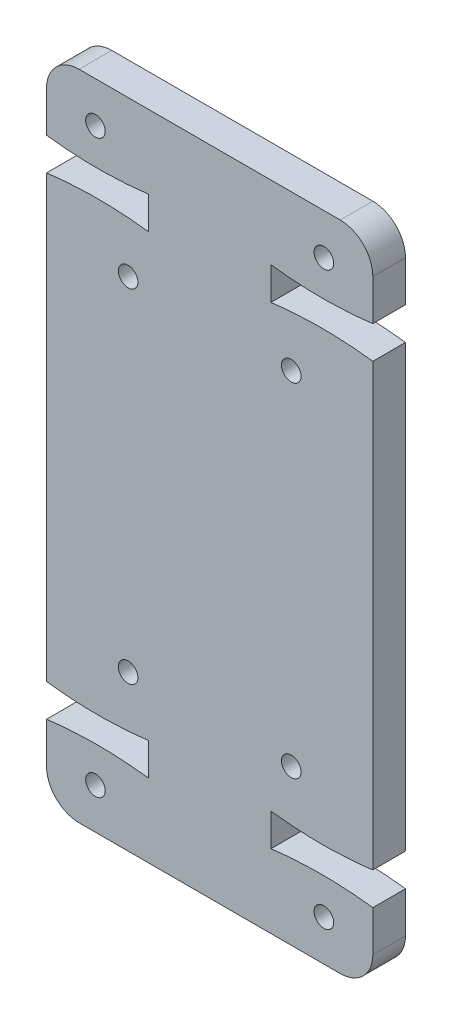
ISO-10303-21;
HEADER;
FILE_DESCRIPTION(('STEP AP214'),'2;1');
FILE_NAME('part.step','',(''),(''),'','','');
FILE_SCHEMA(('AUTOMOTIVE_DESIGN { 1 0 10303 214 1 1 1 1 }'));
ENDSEC;
DATA;
#1=APPLICATION_CONTEXT('core data for automotive mechanical design processes');
#2=APPLICATION_PROTOCOL_DEFINITION('international standard','automotive_design',2000,#1);
#3=PRODUCT_CONTEXT('',#1,'mechanical');
#4=PRODUCT('Part','Part','',(#3));
#5=PRODUCT_RELATED_PRODUCT_CATEGORY('part','',(#4));
#6=PRODUCT_DEFINITION_FORMATION('','',#4);
#7=PRODUCT_DEFINITION_CONTEXT('part definition',#1,'design');
#8=PRODUCT_DEFINITION('design','',#6,#7);
#9=PRODUCT_DEFINITION_SHAPE('','',#8);
#10=(LENGTH_UNIT() NAMED_UNIT(*) SI_UNIT(.MILLI.,.METRE.));
#11=(NAMED_UNIT(*) PLANE_ANGLE_UNIT() SI_UNIT($,.RADIAN.));
#12=(NAMED_UNIT(*) SI_UNIT($,.STERADIAN.) SOLID_ANGLE_UNIT());
#13=UNCERTAINTY_MEASURE_WITH_UNIT(LENGTH_MEASURE(1.E-05),#10,'distance_accuracy_value','');
#14=(GEOMETRIC_REPRESENTATION_CONTEXT(3) GLOBAL_UNCERTAINTY_ASSIGNED_CONTEXT((#13)) GLOBAL_UNIT_ASSIGNED_CONTEXT((#10,
#11,#12)) REPRESENTATION_CONTEXT('',''));
#15=CARTESIAN_POINT('',(0.,0.,0.));
#16=DIRECTION('',(0.,0.,1.));
#17=DIRECTION('',(1.,0.,0.));
#18=AXIS2_PLACEMENT_3D('',#15,#16,#17);
#19=CARTESIAN_POINT('',(16.875,4.7,2.));
#20=DIRECTION('',(0.,0.,-1.));
#21=DIRECTION('',(-1.,0.,0.));
#22=AXIS2_PLACEMENT_3D('',#19,#20,#21);
#23=PLANE('',#22);
#24=CARTESIAN_POINT('',(15.,9.5,2.));
#25=DIRECTION('',(0.,0.,1.));
#26=DIRECTION('',(-1.,0.,0.));
#27=AXIS2_PLACEMENT_3D('',#24,#25,#26);
#28=CIRCLE('',#27,0.6);
#29=CARTESIAN_POINT('',(14.4,9.5,2.));
#30=VERTEX_POINT('',#29);
#31=EDGE_CURVE('E877',#30,#30,#28,.T.);
#32=ORIENTED_EDGE('',*,*,#31,.F.);
#33=EDGE_LOOP('',(#32));
#34=FACE_BOUND('',#33,.T.);
#35=CARTESIAN_POINT('',(17.,37.5,2.));
#36=DIRECTION('',(0.,0.,1.));
#37=DIRECTION('',(1.,0.,0.));
#38=AXIS2_PLACEMENT_3D('',#35,#36,#37);
#39=CIRCLE('',#38,0.600000000000001);
#40=CARTESIAN_POINT('',(17.6,37.5,2.));
#41=VERTEX_POINT('',#40);
#42=EDGE_CURVE('E865',#41,#41,#39,.T.);
#43=ORIENTED_EDGE('',*,*,#42,.F.);
#44=EDGE_LOOP('',(#43));
#45=FACE_BOUND('',#44,.T.);
#46=CARTESIAN_POINT('',(5.,30.5,2.));
#47=DIRECTION('',(0.,0.,1.));
#48=DIRECTION('',(-1.,0.,0.));
#49=AXIS2_PLACEMENT_3D('',#46,#47,#48);
#50=CIRCLE('',#49,0.6);
#51=CARTESIAN_POINT('',(4.4,30.5,2.));
#52=VERTEX_POINT('',#51);
#53=EDGE_CURVE('E853',#52,#52,#50,.T.);
#54=ORIENTED_EDGE('',*,*,#53,.F.);
#55=EDGE_LOOP('',(#54));
#56=FACE_BOUND('',#55,.T.);
#57=CARTESIAN_POINT('',(3.,2.5,2.));
#58=DIRECTION('',(0.,0.,1.));
#59=DIRECTION('',(1.,0.,0.));
#60=AXIS2_PLACEMENT_3D('',#57,#58,#59);
#61=CIRCLE('',#60,0.6);
#62=CARTESIAN_POINT('',(3.6,2.5,2.));
#63=VERTEX_POINT('',#62);
#64=EDGE_CURVE('E299',#63,#63,#61,.T.);
#65=ORIENTED_EDGE('',*,*,#64,.F.);
#66=EDGE_LOOP('',(#65));
#67=FACE_BOUND('',#66,.T.);
#68=DIRECTION('',(-1.,0.,0.));
#69=VECTOR('',#68,1.);
#70=CARTESIAN_POINT('',(0.,40.,2.));
#71=LINE('',#70,#69);
#72=CARTESIAN_POINT('',(18.,40.,2.));
#73=VERTEX_POINT('',#72);
#74=CARTESIAN_POINT('',(2.,40.,2.));
#75=VERTEX_POINT('',#74);
#76=EDGE_CURVE('E734',#73,#75,#71,.T.);
#77=ORIENTED_EDGE('',*,*,#76,.T.);
#78=CARTESIAN_POINT('',(2.,38.,2.));
#79=DIRECTION('',(0.,0.,-1.));
#80=DIRECTION('',(-1.,0.,0.));
#81=AXIS2_PLACEMENT_3D('',#78,#79,#80);
#82=CIRCLE('',#81,2.);
#83=CARTESIAN_POINT('',(0.,38.,2.));
#84=VERTEX_POINT('',#83);
#85=EDGE_CURVE('E441',#75,#84,#82,.F.);
#86=ORIENTED_EDGE('',*,*,#85,.T.);
#87=DIRECTION('',(0.,-1.,0.));
#88=VECTOR('',#87,1.);
#89=CARTESIAN_POINT('',(0.,35.5,2.));
#90=LINE('',#89,#88);
#91=CARTESIAN_POINT('',(0.,35.5,2.));
#92=VERTEX_POINT('',#91);
#93=EDGE_CURVE('E740',#84,#92,#90,.T.);
#94=ORIENTED_EDGE('',*,*,#93,.T.);
#95=CARTESIAN_POINT('',(0.,35.5,2.));
#96=CARTESIAN_POINT('',(3.125,35.1,2.));
#97=CARTESIAN_POINT('',(6.25,35.5,2.));
#98=B_SPLINE_CURVE_WITH_KNOTS('',2,(#95,#96,#97),.UNSPECIFIED.,.F.,.F.,(3,3),(0.,1.),.UNSPECIFIED.);
#99=CARTESIAN_POINT('',(6.25,35.5,2.));
#100=VERTEX_POINT('',#99);
#101=EDGE_CURVE('E742',#92,#100,#98,.T.);
#102=ORIENTED_EDGE('',*,*,#101,.T.);
#103=DIRECTION('',(0.,-1.,0.));
#104=VECTOR('',#103,1.);
#105=CARTESIAN_POINT('',(6.25,35.5,2.));
#106=LINE('',#105,#104);
#107=CARTESIAN_POINT('',(6.25,33.5,2.));
#108=VERTEX_POINT('',#107);
#109=EDGE_CURVE('E750',#100,#108,#106,.T.);
#110=ORIENTED_EDGE('',*,*,#109,.T.);
#111=CARTESIAN_POINT('',(6.25,33.5,2.));
#112=CARTESIAN_POINT('',(3.125,33.9,2.));
#113=CARTESIAN_POINT('',(0.,33.5,2.));
#114=B_SPLINE_CURVE_WITH_KNOTS('',2,(#111,#112,#113),.UNSPECIFIED.,.F.,.F.,(3,3),(0.,1.),.UNSPECIFIED.);
#115=CARTESIAN_POINT('',(0.,33.5,2.));
#116=VERTEX_POINT('',#115);
#117=EDGE_CURVE('E812',#108,#116,#114,.T.);
#118=ORIENTED_EDGE('',*,*,#117,.T.);
#119=DIRECTION('',(0.,-1.,0.));
#120=VECTOR('',#119,1.);
#121=CARTESIAN_POINT('',(0.,6.49999999999997,2.));
#122=LINE('',#121,#120);
#123=CARTESIAN_POINT('',(0.,6.49999999999997,2.));
#124=VERTEX_POINT('',#123);
#125=EDGE_CURVE('E816',#116,#124,#122,.T.);
#126=ORIENTED_EDGE('',*,*,#125,.T.);
#127=CARTESIAN_POINT('',(0.,6.49999999999997,2.));
#128=CARTESIAN_POINT('',(3.125,6.09999999999998,2.));
#129=CARTESIAN_POINT('',(6.25,6.49999999999997,2.));
#130=B_SPLINE_CURVE_WITH_KNOTS('',2,(#127,#128,#129),.UNSPECIFIED.,.F.,.F.,(3,3),(0.,1.),.UNSPECIFIED.);
#131=CARTESIAN_POINT('',(6.25,6.49999999999997,2.));
#132=VERTEX_POINT('',#131);
#133=EDGE_CURVE('E817',#124,#132,#130,.T.);
#134=ORIENTED_EDGE('',*,*,#133,.T.);
#135=DIRECTION('',(0.,-1.,0.));
#136=VECTOR('',#135,1.);
#137=CARTESIAN_POINT('',(6.25,4.5,2.));
#138=LINE('',#137,#136);
#139=CARTESIAN_POINT('',(6.25,4.5,2.));
#140=VERTEX_POINT('',#139);
#141=EDGE_CURVE('E290',#132,#140,#138,.T.);
#142=ORIENTED_EDGE('',*,*,#141,.T.);
#143=CARTESIAN_POINT('',(6.25,4.5,2.));
#144=CARTESIAN_POINT('',(3.125,4.9,2.));
#145=CARTESIAN_POINT('',(0.,4.5,2.));
#146=B_SPLINE_CURVE_WITH_KNOTS('',2,(#143,#144,#145),.UNSPECIFIED.,.F.,.F.,(3,3),(0.,1.),.UNSPECIFIED.);
#147=CARTESIAN_POINT('',(0.,4.5,2.));
#148=VERTEX_POINT('',#147);
#149=EDGE_CURVE('E283',#140,#148,#146,.T.);
#150=ORIENTED_EDGE('',*,*,#149,.T.);
#151=DIRECTION('',(0.,-1.,0.));
#152=VECTOR('',#151,1.);
#153=CARTESIAN_POINT('',(0.,4.5,2.));
#154=LINE('',#153,#152);
#155=CARTESIAN_POINT('',(0.,2.,2.));
#156=VERTEX_POINT('',#155);
#157=EDGE_CURVE('E375',#148,#156,#154,.T.);
#158=ORIENTED_EDGE('',*,*,#157,.T.);
#159=CARTESIAN_POINT('',(2.,2.,2.));
#160=DIRECTION('',(0.,0.,-1.));
#161=DIRECTION('',(-1.,0.,0.));
#162=AXIS2_PLACEMENT_3D('',#159,#160,#161);
#163=CIRCLE('',#162,2.);
#164=CARTESIAN_POINT('',(2.,0.,2.));
#165=VERTEX_POINT('',#164);
#166=EDGE_CURVE('E436',#156,#165,#163,.F.);
#167=ORIENTED_EDGE('',*,*,#166,.T.);
#168=DIRECTION('',(1.,0.,0.));
#169=VECTOR('',#168,1.);
#170=CARTESIAN_POINT('',(0.,0.,2.));
#171=LINE('',#170,#169);
#172=CARTESIAN_POINT('',(18.,0.,2.));
#173=VERTEX_POINT('',#172);
#174=EDGE_CURVE('E203',#165,#173,#171,.T.);
#175=ORIENTED_EDGE('',*,*,#174,.T.);
#176=CARTESIAN_POINT('',(18.,2.,2.));
#177=DIRECTION('',(0.,0.,-1.));
#178=DIRECTION('',(-1.,0.,0.));
#179=AXIS2_PLACEMENT_3D('',#176,#177,#178);
#180=CIRCLE('',#179,2.);
#181=CARTESIAN_POINT('',(20.,2.,2.));
#182=VERTEX_POINT('',#181);
#183=EDGE_CURVE('E56',#173,#182,#180,.F.);
#184=ORIENTED_EDGE('',*,*,#183,.T.);
#185=DIRECTION('',(0.,1.,0.));
#186=VECTOR('',#185,1.);
#187=CARTESIAN_POINT('',(20.,4.5,2.));
#188=LINE('',#187,#186);
#189=CARTESIAN_POINT('',(20.,4.5,2.));
#190=VERTEX_POINT('',#189);
#191=EDGE_CURVE('E193',#182,#190,#188,.T.);
#192=ORIENTED_EDGE('',*,*,#191,.T.);
#193=CARTESIAN_POINT('',(20.,4.5,2.));
#194=CARTESIAN_POINT('',(16.875,4.9,2.));
#195=CARTESIAN_POINT('',(13.75,4.5,2.));
#196=B_SPLINE_CURVE_WITH_KNOTS('',2,(#193,#194,#195),.UNSPECIFIED.,.F.,.F.,(3,3),(0.,1.),.UNSPECIFIED.);
#197=CARTESIAN_POINT('',(13.75,4.5,2.));
#198=VERTEX_POINT('',#197);
#199=EDGE_CURVE('E198',#190,#198,#196,.T.);
#200=ORIENTED_EDGE('',*,*,#199,.T.);
#201=DIRECTION('',(0.,1.,0.));
#202=VECTOR('',#201,1.);
#203=CARTESIAN_POINT('',(13.75,4.5,2.));
#204=LINE('',#203,#202);
#205=CARTESIAN_POINT('',(13.75,6.49999999999997,2.));
#206=VERTEX_POINT('',#205);
#207=EDGE_CURVE('E218',#198,#206,#204,.T.);
#208=ORIENTED_EDGE('',*,*,#207,.T.);
#209=CARTESIAN_POINT('',(13.75,6.49999999999997,2.));
#210=CARTESIAN_POINT('',(16.875,6.09999999999997,2.));
#211=CARTESIAN_POINT('',(20.,6.49999999999997,2.));
#212=B_SPLINE_CURVE_WITH_KNOTS('',2,(#209,#210,#211),.UNSPECIFIED.,.F.,.F.,(3,3),(0.,1.),.UNSPECIFIED.);
#213=CARTESIAN_POINT('',(20.,6.49999999999997,2.));
#214=VERTEX_POINT('',#213);
#215=EDGE_CURVE('E220',#206,#214,#212,.T.);
#216=ORIENTED_EDGE('',*,*,#215,.T.);
#217=DIRECTION('',(0.,1.,0.));
#218=VECTOR('',#217,1.);
#219=CARTESIAN_POINT('',(20.,6.49999999999997,2.));
#220=LINE('',#219,#218);
#221=CARTESIAN_POINT('',(20.,33.5,2.));
#222=VERTEX_POINT('',#221);
#223=EDGE_CURVE('E464',#214,#222,#220,.T.);
#224=ORIENTED_EDGE('',*,*,#223,.T.);
#225=CARTESIAN_POINT('',(20.,33.5,2.));
#226=CARTESIAN_POINT('',(16.875,33.9,2.));
#227=CARTESIAN_POINT('',(13.75,33.5,2.));
#228=B_SPLINE_CURVE_WITH_KNOTS('',2,(#225,#226,#227),.UNSPECIFIED.,.F.,.F.,(3,3),(0.,1.),.UNSPECIFIED.);
#229=CARTESIAN_POINT('',(13.75,33.5,2.));
#230=VERTEX_POINT('',#229);
#231=EDGE_CURVE('E472',#222,#230,#228,.T.);
#232=ORIENTED_EDGE('',*,*,#231,.T.);
#233=DIRECTION('',(0.,1.,0.));
#234=VECTOR('',#233,1.);
#235=CARTESIAN_POINT('',(13.75,35.5,2.));
#236=LINE('',#235,#234);
#237=CARTESIAN_POINT('',(13.75,35.5,2.));
#238=VERTEX_POINT('',#237);
#239=EDGE_CURVE('E474',#230,#238,#236,.T.);
#240=ORIENTED_EDGE('',*,*,#239,.T.);
#241=CARTESIAN_POINT('',(13.75,35.5,2.));
#242=CARTESIAN_POINT('',(16.875,35.1,2.));
#243=CARTESIAN_POINT('',(20.,35.5,2.));
#244=B_SPLINE_CURVE_WITH_KNOTS('',2,(#241,#242,#243),.UNSPECIFIED.,.F.,.F.,(3,3),(0.,1.),.UNSPECIFIED.);
#245=CARTESIAN_POINT('',(20.,35.5,2.));
#246=VERTEX_POINT('',#245);
#247=EDGE_CURVE('E728',#238,#246,#244,.T.);
#248=ORIENTED_EDGE('',*,*,#247,.T.);
#249=DIRECTION('',(0.,1.,0.));
#250=VECTOR('',#249,1.);
#251=CARTESIAN_POINT('',(20.,35.5,2.));
#252=LINE('',#251,#250);
#253=CARTESIAN_POINT('',(20.,38.,2.));
#254=VERTEX_POINT('',#253);
#255=EDGE_CURVE('E736',#246,#254,#252,.T.);
#256=ORIENTED_EDGE('',*,*,#255,.T.);
#257=CARTESIAN_POINT('',(18.,38.,2.));
#258=DIRECTION('',(0.,0.,-1.));
#259=DIRECTION('',(-1.,0.,0.));
#260=AXIS2_PLACEMENT_3D('',#257,#258,#259);
#261=CIRCLE('',#260,2.);
#262=EDGE_CURVE('E439',#254,#73,#261,.F.);
#263=ORIENTED_EDGE('',*,*,#262,.T.);
#264=EDGE_LOOP('',(#77,#86,#94,#102,#110,#118,#126,#134,#142,#150,#158,#167,#175,#184,#192,#200,
#208,#216,#224,#232,#240,#248,#256,#263));
#265=FACE_BOUND('',#264,.T.);
#266=CARTESIAN_POINT('',(5.,9.5,2.));
#267=DIRECTION('',(0.,0.,1.));
#268=DIRECTION('',(1.,0.,0.));
#269=AXIS2_PLACEMENT_3D('',#266,#267,#268);
#270=CIRCLE('',#269,0.6);
#271=CARTESIAN_POINT('',(5.6,9.5,2.));
#272=VERTEX_POINT('',#271);
#273=EDGE_CURVE('E847',#272,#272,#270,.T.);
#274=ORIENTED_EDGE('',*,*,#273,.F.);
#275=EDGE_LOOP('',(#274));
#276=FACE_BOUND('',#275,.T.);
#277=CARTESIAN_POINT('',(3.,37.5,2.));
#278=DIRECTION('',(0.,0.,1.));
#279=DIRECTION('',(-1.,0.,0.));
#280=AXIS2_PLACEMENT_3D('',#277,#278,#279);
#281=CIRCLE('',#280,0.600000000000001);
#282=CARTESIAN_POINT('',(2.4,37.5,2.));
#283=VERTEX_POINT('',#282);
#284=EDGE_CURVE('E859',#283,#283,#281,.T.);
#285=ORIENTED_EDGE('',*,*,#284,.F.);
#286=EDGE_LOOP('',(#285));
#287=FACE_BOUND('',#286,.T.);
#288=CARTESIAN_POINT('',(15.,30.5,2.));
#289=DIRECTION('',(0.,0.,1.));
#290=DIRECTION('',(1.,0.,0.));
#291=AXIS2_PLACEMENT_3D('',#288,#289,#290);
#292=CIRCLE('',#291,0.6);
#293=CARTESIAN_POINT('',(15.6,30.5,2.));
#294=VERTEX_POINT('',#293);
#295=EDGE_CURVE('E871',#294,#294,#292,.T.);
#296=ORIENTED_EDGE('',*,*,#295,.F.);
#297=EDGE_LOOP('',(#296));
#298=FACE_BOUND('',#297,.T.);
#299=CARTESIAN_POINT('',(17.,2.5,2.));
#300=DIRECTION('',(0.,0.,1.));
#301=DIRECTION('',(-1.,0.,0.));
#302=AXIS2_PLACEMENT_3D('',#299,#300,#301);
#303=CIRCLE('',#302,0.6);
#304=CARTESIAN_POINT('',(16.4,2.5,2.));
#305=VERTEX_POINT('',#304);
#306=EDGE_CURVE('E883',#305,#305,#303,.T.);
#307=ORIENTED_EDGE('',*,*,#306,.F.);
#308=EDGE_LOOP('',(#307));
#309=FACE_BOUND('',#308,.T.);
#310=ADVANCED_FACE('F33',(#34,#45,#56,#67,#265,#276,#287,#298,#309),#23,.F.);
#311=CARTESIAN_POINT('',(16.875,4.7,0.));
#312=DIRECTION('',(0.,0.,-1.));
#313=DIRECTION('',(-1.,0.,0.));
#314=AXIS2_PLACEMENT_3D('',#311,#312,#313);
#315=PLANE('',#314);
#316=CARTESIAN_POINT('',(15.,9.5,0.));
#317=DIRECTION('',(0.,0.,1.));
#318=DIRECTION('',(-1.,0.,0.));
#319=AXIS2_PLACEMENT_3D('',#316,#317,#318);
#320=CIRCLE('',#319,0.6);
#321=CARTESIAN_POINT('',(14.4,9.5,0.));
#322=VERTEX_POINT('',#321);
#323=EDGE_CURVE('E880',#322,#322,#320,.T.);
#324=ORIENTED_EDGE('',*,*,#323,.T.);
#325=EDGE_LOOP('',(#324));
#326=FACE_BOUND('',#325,.T.);
#327=CARTESIAN_POINT('',(17.,37.5,0.));
#328=DIRECTION('',(0.,0.,1.));
#329=DIRECTION('',(1.,0.,0.));
#330=AXIS2_PLACEMENT_3D('',#327,#328,#329);
#331=CIRCLE('',#330,0.600000000000001);
#332=CARTESIAN_POINT('',(17.6,37.5,0.));
#333=VERTEX_POINT('',#332);
#334=EDGE_CURVE('E868',#333,#333,#331,.T.);
#335=ORIENTED_EDGE('',*,*,#334,.T.);
#336=EDGE_LOOP('',(#335));
#337=FACE_BOUND('',#336,.T.);
#338=CARTESIAN_POINT('',(5.,30.5,0.));
#339=DIRECTION('',(0.,0.,1.));
#340=DIRECTION('',(-1.,0.,0.));
#341=AXIS2_PLACEMENT_3D('',#338,#339,#340);
#342=CIRCLE('',#341,0.6);
#343=CARTESIAN_POINT('',(4.4,30.5,0.));
#344=VERTEX_POINT('',#343);
#345=EDGE_CURVE('E856',#344,#344,#342,.T.);
#346=ORIENTED_EDGE('',*,*,#345,.T.);
#347=EDGE_LOOP('',(#346));
#348=FACE_BOUND('',#347,.T.);
#349=CARTESIAN_POINT('',(3.,2.5,0.));
#350=DIRECTION('',(0.,0.,1.));
#351=DIRECTION('',(1.,0.,0.));
#352=AXIS2_PLACEMENT_3D('',#349,#350,#351);
#353=CIRCLE('',#352,0.6);
#354=CARTESIAN_POINT('',(3.6,2.5,0.));
#355=VERTEX_POINT('',#354);
#356=EDGE_CURVE('E844',#355,#355,#353,.T.);
#357=ORIENTED_EDGE('',*,*,#356,.T.);
#358=EDGE_LOOP('',(#357));
#359=FACE_BOUND('',#358,.T.);
#360=DIRECTION('',(0.,-1.,0.));
#361=VECTOR('',#360,1.);
#362=CARTESIAN_POINT('',(0.,35.5,0.));
#363=LINE('',#362,#361);
#364=CARTESIAN_POINT('',(0.,38.,0.));
#365=VERTEX_POINT('',#364);
#366=CARTESIAN_POINT('',(0.,35.5,0.));
#367=VERTEX_POINT('',#366);
#368=EDGE_CURVE('E342',#365,#367,#363,.T.);
#369=ORIENTED_EDGE('',*,*,#368,.F.);
#370=CARTESIAN_POINT('',(2.,38.,0.));
#371=DIRECTION('',(0.,0.,-1.));
#372=DIRECTION('',(-1.,0.,0.));
#373=AXIS2_PLACEMENT_3D('',#370,#371,#372);
#374=CIRCLE('',#373,2.);
#375=CARTESIAN_POINT('',(2.,40.,0.));
#376=VERTEX_POINT('',#375);
#377=EDGE_CURVE('E429',#365,#376,#374,.T.);
#378=ORIENTED_EDGE('',*,*,#377,.T.);
#379=DIRECTION('',(-1.,0.,0.));
#380=VECTOR('',#379,1.);
#381=CARTESIAN_POINT('',(0.,40.,0.));
#382=LINE('',#381,#380);
#383=CARTESIAN_POINT('',(18.,40.,0.));
#384=VERTEX_POINT('',#383);
#385=EDGE_CURVE('E339',#384,#376,#382,.T.);
#386=ORIENTED_EDGE('',*,*,#385,.F.);
#387=CARTESIAN_POINT('',(18.,38.,0.));
#388=DIRECTION('',(0.,0.,-1.));
#389=DIRECTION('',(-1.,0.,0.));
#390=AXIS2_PLACEMENT_3D('',#387,#388,#389);
#391=CIRCLE('',#390,2.);
#392=CARTESIAN_POINT('',(20.,38.,0.));
#393=VERTEX_POINT('',#392);
#394=EDGE_CURVE('E427',#384,#393,#391,.T.);
#395=ORIENTED_EDGE('',*,*,#394,.T.);
#396=DIRECTION('',(0.,1.,0.));
#397=VECTOR('',#396,1.);
#398=CARTESIAN_POINT('',(20.,35.5,0.));
#399=LINE('',#398,#397);
#400=CARTESIAN_POINT('',(20.,35.5,0.));
#401=VERTEX_POINT('',#400);
#402=EDGE_CURVE('E334',#401,#393,#399,.T.);
#403=ORIENTED_EDGE('',*,*,#402,.F.);
#404=CARTESIAN_POINT('',(13.75,35.5,0.));
#405=CARTESIAN_POINT('',(16.875,35.1,0.));
#406=CARTESIAN_POINT('',(20.,35.5,0.));
#407=B_SPLINE_CURVE_WITH_KNOTS('',2,(#404,#405,#406),.UNSPECIFIED.,.F.,.F.,(3,3),(0.,1.),.UNSPECIFIED.);
#408=CARTESIAN_POINT('',(13.75,35.5,0.));
#409=VERTEX_POINT('',#408);
#410=EDGE_CURVE('E330',#409,#401,#407,.T.);
#411=ORIENTED_EDGE('',*,*,#410,.F.);
#412=DIRECTION('',(0.,1.,0.));
#413=VECTOR('',#412,1.);
#414=CARTESIAN_POINT('',(13.75,35.5,0.));
#415=LINE('',#414,#413);
#416=CARTESIAN_POINT('',(13.75,33.5,0.));
#417=VERTEX_POINT('',#416);
#418=EDGE_CURVE('E325',#417,#409,#415,.T.);
#419=ORIENTED_EDGE('',*,*,#418,.F.);
#420=CARTESIAN_POINT('',(20.,33.5,0.));
#421=CARTESIAN_POINT('',(16.875,33.9,0.));
#422=CARTESIAN_POINT('',(13.75,33.5,0.));
#423=B_SPLINE_CURVE_WITH_KNOTS('',2,(#420,#421,#422),.UNSPECIFIED.,.F.,.F.,(3,3),(0.,1.),.UNSPECIFIED.);
#424=CARTESIAN_POINT('',(20.,33.5,0.));
#425=VERTEX_POINT('',#424);
#426=EDGE_CURVE('E321',#425,#417,#423,.T.);
#427=ORIENTED_EDGE('',*,*,#426,.F.);
#428=DIRECTION('',(0.,1.,0.));
#429=VECTOR('',#428,1.);
#430=CARTESIAN_POINT('',(20.,6.49999999999997,0.));
#431=LINE('',#430,#429);
#432=CARTESIAN_POINT('',(20.,6.49999999999997,0.));
#433=VERTEX_POINT('',#432);
#434=EDGE_CURVE('E316',#433,#425,#431,.T.);
#435=ORIENTED_EDGE('',*,*,#434,.F.);
#436=CARTESIAN_POINT('',(13.75,6.49999999999997,0.));
#437=CARTESIAN_POINT('',(16.875,6.09999999999997,0.));
#438=CARTESIAN_POINT('',(20.,6.49999999999997,0.));
#439=B_SPLINE_CURVE_WITH_KNOTS('',2,(#436,#437,#438),.UNSPECIFIED.,.F.,.F.,(3,3),(0.,1.),.UNSPECIFIED.);
#440=CARTESIAN_POINT('',(13.75,6.49999999999997,0.));
#441=VERTEX_POINT('',#440);
#442=EDGE_CURVE('E312',#441,#433,#439,.T.);
#443=ORIENTED_EDGE('',*,*,#442,.F.);
#444=DIRECTION('',(0.,1.,0.));
#445=VECTOR('',#444,1.);
#446=CARTESIAN_POINT('',(13.75,4.5,0.));
#447=LINE('',#446,#445);
#448=CARTESIAN_POINT('',(13.75,4.5,0.));
#449=VERTEX_POINT('',#448);
#450=EDGE_CURVE('E307',#449,#441,#447,.T.);
#451=ORIENTED_EDGE('',*,*,#450,.F.);
#452=CARTESIAN_POINT('',(20.,4.5,0.));
#453=CARTESIAN_POINT('',(16.875,4.9,0.));
#454=CARTESIAN_POINT('',(13.75,4.5,0.));
#455=B_SPLINE_CURVE_WITH_KNOTS('',2,(#452,#453,#454),.UNSPECIFIED.,.F.,.F.,(3,3),(0.,1.),.UNSPECIFIED.);
#456=CARTESIAN_POINT('',(20.,4.5,0.));
#457=VERTEX_POINT('',#456);
#458=EDGE_CURVE('E303',#457,#449,#455,.T.);
#459=ORIENTED_EDGE('',*,*,#458,.F.);
#460=DIRECTION('',(0.,1.,0.));
#461=VECTOR('',#460,1.);
#462=CARTESIAN_POINT('',(20.,4.5,0.));
#463=LINE('',#462,#461);
#464=CARTESIAN_POINT('',(20.,2.,0.));
#465=VERTEX_POINT('',#464);
#466=EDGE_CURVE('E209',#465,#457,#463,.T.);
#467=ORIENTED_EDGE('',*,*,#466,.F.);
#468=CARTESIAN_POINT('',(18.,2.,0.));
#469=DIRECTION('',(0.,0.,-1.));
#470=DIRECTION('',(-1.,0.,0.));
#471=AXIS2_PLACEMENT_3D('',#468,#469,#470);
#472=CIRCLE('',#471,2.);
#473=CARTESIAN_POINT('',(18.,0.,0.));
#474=VERTEX_POINT('',#473);
#475=EDGE_CURVE('E425',#465,#474,#472,.T.);
#476=ORIENTED_EDGE('',*,*,#475,.T.);
#477=DIRECTION('',(1.,0.,0.));
#478=VECTOR('',#477,1.);
#479=CARTESIAN_POINT('',(0.,0.,0.));
#480=LINE('',#479,#478);
#481=CARTESIAN_POINT('',(2.,0.,0.));
#482=VERTEX_POINT('',#481);
#483=EDGE_CURVE('E298',#482,#474,#480,.T.);
#484=ORIENTED_EDGE('',*,*,#483,.F.);
#485=CARTESIAN_POINT('',(2.,2.,0.));
#486=DIRECTION('',(0.,0.,-1.));
#487=DIRECTION('',(-1.,0.,0.));
#488=AXIS2_PLACEMENT_3D('',#485,#486,#487);
#489=CIRCLE('',#488,2.);
#490=CARTESIAN_POINT('',(0.,2.,0.));
#491=VERTEX_POINT('',#490);
#492=EDGE_CURVE('E423',#482,#491,#489,.T.);
#493=ORIENTED_EDGE('',*,*,#492,.T.);
#494=DIRECTION('',(0.,-1.,0.));
#495=VECTOR('',#494,1.);
#496=CARTESIAN_POINT('',(0.,4.5,0.));
#497=LINE('',#496,#495);
#498=CARTESIAN_POINT('',(0.,4.5,0.));
#499=VERTEX_POINT('',#498);
#500=EDGE_CURVE('E292',#499,#491,#497,.T.);
#501=ORIENTED_EDGE('',*,*,#500,.F.);
#502=CARTESIAN_POINT('',(6.25,4.5,0.));
#503=CARTESIAN_POINT('',(3.125,4.9,0.));
#504=CARTESIAN_POINT('',(0.,4.5,0.));
#505=B_SPLINE_CURVE_WITH_KNOTS('',2,(#502,#503,#504),.UNSPECIFIED.,.F.,.F.,(3,3),(0.,1.),.UNSPECIFIED.);
#506=CARTESIAN_POINT('',(6.25,4.5,0.));
#507=VERTEX_POINT('',#506);
#508=EDGE_CURVE('E371',#507,#499,#505,.T.);
#509=ORIENTED_EDGE('',*,*,#508,.F.);
#510=DIRECTION('',(0.,-1.,0.));
#511=VECTOR('',#510,1.);
#512=CARTESIAN_POINT('',(6.25,4.5,0.));
#513=LINE('',#512,#511);
#514=CARTESIAN_POINT('',(6.25,6.49999999999997,0.));
#515=VERTEX_POINT('',#514);
#516=EDGE_CURVE('E366',#515,#507,#513,.T.);
#517=ORIENTED_EDGE('',*,*,#516,.F.);
#518=CARTESIAN_POINT('',(0.,6.49999999999997,0.));
#519=CARTESIAN_POINT('',(3.125,6.09999999999998,0.));
#520=CARTESIAN_POINT('',(6.25,6.49999999999997,0.));
#521=B_SPLINE_CURVE_WITH_KNOTS('',2,(#518,#519,#520),.UNSPECIFIED.,.F.,.F.,(3,3),(0.,1.),.UNSPECIFIED.);
#522=CARTESIAN_POINT('',(0.,6.49999999999997,0.));
#523=VERTEX_POINT('',#522);
#524=EDGE_CURVE('E362',#523,#515,#521,.T.);
#525=ORIENTED_EDGE('',*,*,#524,.F.);
#526=DIRECTION('',(0.,-1.,0.));
#527=VECTOR('',#526,1.);
#528=CARTESIAN_POINT('',(0.,6.49999999999997,0.));
#529=LINE('',#528,#527);
#530=CARTESIAN_POINT('',(0.,33.5,0.));
#531=VERTEX_POINT('',#530);
#532=EDGE_CURVE('E357',#531,#523,#529,.T.);
#533=ORIENTED_EDGE('',*,*,#532,.F.);
#534=CARTESIAN_POINT('',(6.25,33.5,0.));
#535=CARTESIAN_POINT('',(3.125,33.9,0.));
#536=CARTESIAN_POINT('',(0.,33.5,0.));
#537=B_SPLINE_CURVE_WITH_KNOTS('',2,(#534,#535,#536),.UNSPECIFIED.,.F.,.F.,(3,3),(0.,1.),.UNSPECIFIED.);
#538=CARTESIAN_POINT('',(6.25,33.5,0.));
#539=VERTEX_POINT('',#538);
#540=EDGE_CURVE('E353',#539,#531,#537,.T.);
#541=ORIENTED_EDGE('',*,*,#540,.F.);
#542=DIRECTION('',(0.,-1.,0.));
#543=VECTOR('',#542,1.);
#544=CARTESIAN_POINT('',(6.25,35.5,0.));
#545=LINE('',#544,#543);
#546=CARTESIAN_POINT('',(6.25,35.5,0.));
#547=VERTEX_POINT('',#546);
#548=EDGE_CURVE('E348',#547,#539,#545,.T.);
#549=ORIENTED_EDGE('',*,*,#548,.F.);
#550=CARTESIAN_POINT('',(0.,35.5,0.));
#551=CARTESIAN_POINT('',(3.125,35.1,0.));
#552=CARTESIAN_POINT('',(6.25,35.5,0.));
#553=B_SPLINE_CURVE_WITH_KNOTS('',2,(#550,#551,#552),.UNSPECIFIED.,.F.,.F.,(3,3),(0.,1.),.UNSPECIFIED.);
#554=EDGE_CURVE('E344',#367,#547,#553,.T.);
#555=ORIENTED_EDGE('',*,*,#554,.F.);
#556=EDGE_LOOP('',(#369,#378,#386,#395,#403,#411,#419,#427,#435,#443,#451,#459,#467,#476,#484,
#493,#501,#509,#517,#525,#533,#541,#549,#555));
#557=FACE_BOUND('',#556,.T.);
#558=CARTESIAN_POINT('',(5.,9.5,0.));
#559=DIRECTION('',(0.,0.,1.));
#560=DIRECTION('',(1.,0.,0.));
#561=AXIS2_PLACEMENT_3D('',#558,#559,#560);
#562=CIRCLE('',#561,0.6);
#563=CARTESIAN_POINT('',(5.6,9.5,0.));
#564=VERTEX_POINT('',#563);
#565=EDGE_CURVE('E850',#564,#564,#562,.T.);
#566=ORIENTED_EDGE('',*,*,#565,.T.);
#567=EDGE_LOOP('',(#566));
#568=FACE_BOUND('',#567,.T.);
#569=CARTESIAN_POINT('',(3.,37.5,0.));
#570=DIRECTION('',(0.,0.,1.));
#571=DIRECTION('',(-1.,0.,0.));
#572=AXIS2_PLACEMENT_3D('',#569,#570,#571);
#573=CIRCLE('',#572,0.600000000000001);
#574=CARTESIAN_POINT('',(2.4,37.5,0.));
#575=VERTEX_POINT('',#574);
#576=EDGE_CURVE('E862',#575,#575,#573,.T.);
#577=ORIENTED_EDGE('',*,*,#576,.T.);
#578=EDGE_LOOP('',(#577));
#579=FACE_BOUND('',#578,.T.);
#580=CARTESIAN_POINT('',(15.,30.5,0.));
#581=DIRECTION('',(0.,0.,1.));
#582=DIRECTION('',(1.,0.,0.));
#583=AXIS2_PLACEMENT_3D('',#580,#581,#582);
#584=CIRCLE('',#583,0.6);
#585=CARTESIAN_POINT('',(15.6,30.5,0.));
#586=VERTEX_POINT('',#585);
#587=EDGE_CURVE('E874',#586,#586,#584,.T.);
#588=ORIENTED_EDGE('',*,*,#587,.T.);
#589=EDGE_LOOP('',(#588));
#590=FACE_BOUND('',#589,.T.);
#591=CARTESIAN_POINT('',(17.,2.5,0.));
#592=DIRECTION('',(0.,0.,1.));
#593=DIRECTION('',(-1.,0.,0.));
#594=AXIS2_PLACEMENT_3D('',#591,#592,#593);
#595=CIRCLE('',#594,0.6);
#596=CARTESIAN_POINT('',(16.4,2.5,0.));
#597=VERTEX_POINT('',#596);
#598=EDGE_CURVE('E886',#597,#597,#595,.T.);
#599=ORIENTED_EDGE('',*,*,#598,.T.);
#600=EDGE_LOOP('',(#599));
#601=FACE_BOUND('',#600,.T.);
#602=ADVANCED_FACE('F245',(#326,#337,#348,#359,#557,#568,#579,#590,#601),#315,.T.);
#603=CARTESIAN_POINT('',(0.,4.5,2.));
#604=DIRECTION('',(1.,0.,0.));
#605=DIRECTION('',(0.,0.,-1.));
#606=AXIS2_PLACEMENT_3D('',#603,#604,#605);
#607=PLANE('',#606);
#608=ORIENTED_EDGE('',*,*,#500,.T.);
#609=DIRECTION('',(0.,0.,-1.));
#610=VECTOR('',#609,1.);
#611=CARTESIAN_POINT('',(0.,2.,2.));
#612=LINE('',#611,#610);
#613=EDGE_CURVE('E11',#491,#156,#612,.F.);
#614=ORIENTED_EDGE('',*,*,#613,.T.);
#615=ORIENTED_EDGE('',*,*,#157,.F.);
#616=DIRECTION('',(0.,0.,-1.));
#617=VECTOR('',#616,1.);
#618=CARTESIAN_POINT('',(0.,4.5,2.));
#619=LINE('',#618,#617);
#620=EDGE_CURVE('E289',#148,#499,#619,.T.);
#621=ORIENTED_EDGE('',*,*,#620,.T.);
#622=EDGE_LOOP('',(#608,#614,#615,#621));
#623=FACE_BOUND('',#622,.T.);
#624=ADVANCED_FACE('F241',(#623),#607,.F.);
#625=CARTESIAN_POINT('',(0.,0.,2.));
#626=DIRECTION('',(0.,1.,0.));
#627=DIRECTION('',(0.,0.,1.));
#628=AXIS2_PLACEMENT_3D('',#625,#626,#627);
#629=PLANE('',#628);
#630=ORIENTED_EDGE('',*,*,#483,.T.);
#631=DIRECTION('',(0.,0.,-1.));
#632=VECTOR('',#631,1.);
#633=CARTESIAN_POINT('',(18.,0.,2.));
#634=LINE('',#633,#632);
#635=EDGE_CURVE('E41',#474,#173,#634,.F.);
#636=ORIENTED_EDGE('',*,*,#635,.T.);
#637=ORIENTED_EDGE('',*,*,#174,.F.);
#638=DIRECTION('',(0.,0.,-1.));
#639=VECTOR('',#638,1.);
#640=CARTESIAN_POINT('',(2.,0.,2.));
#641=LINE('',#640,#639);
#642=EDGE_CURVE('E446',#165,#482,#641,.T.);
#643=ORIENTED_EDGE('',*,*,#642,.T.);
#644=EDGE_LOOP('',(#630,#636,#637,#643));
#645=FACE_BOUND('',#644,.T.);
#646=ADVANCED_FACE('F238',(#645),#629,.F.);
#647=CARTESIAN_POINT('',(20.,4.5,2.));
#648=DIRECTION('',(-1.,0.,0.));
#649=DIRECTION('',(0.,0.,1.));
#650=AXIS2_PLACEMENT_3D('',#647,#648,#649);
#651=PLANE('',#650);
#652=ORIENTED_EDGE('',*,*,#191,.F.);
#653=DIRECTION('',(0.,0.,-1.));
#654=VECTOR('',#653,1.);
#655=CARTESIAN_POINT('',(20.,2.,2.));
#656=LINE('',#655,#654);
#657=EDGE_CURVE('E444',#182,#465,#656,.T.);
#658=ORIENTED_EDGE('',*,*,#657,.T.);
#659=ORIENTED_EDGE('',*,*,#466,.T.);
#660=DIRECTION('',(0.,0.,-1.));
#661=VECTOR('',#660,1.);
#662=CARTESIAN_POINT('',(20.,4.5,2.));
#663=LINE('',#662,#661);
#664=EDGE_CURVE('E206',#190,#457,#663,.T.);
#665=ORIENTED_EDGE('',*,*,#664,.F.);
#666=EDGE_LOOP('',(#652,#658,#659,#665));
#667=FACE_BOUND('',#666,.T.);
#668=ADVANCED_FACE('F207',(#667),#651,.F.);
#669=DIRECTION('',(0.,0.,-1.));
#670=VECTOR('',#669,1.);
#671=SURFACE_OF_LINEAR_EXTRUSION('',#196,#670);
#672=ORIENTED_EDGE('',*,*,#458,.T.);
#673=DIRECTION('',(0.,0.,-1.));
#674=VECTOR('',#673,1.);
#675=CARTESIAN_POINT('',(13.75,4.5,2.));
#676=LINE('',#675,#674);
#677=EDGE_CURVE('E213',#198,#449,#676,.T.);
#678=ORIENTED_EDGE('',*,*,#677,.F.);
#679=ORIENTED_EDGE('',*,*,#199,.F.);
#680=ORIENTED_EDGE('',*,*,#664,.T.);
#681=EDGE_LOOP('',(#672,#678,#679,#680));
#682=FACE_BOUND('',#681,.T.);
#683=ADVANCED_FACE('F215',(#682),#671,.F.);
#684=CARTESIAN_POINT('',(13.75,4.5,2.));
#685=DIRECTION('',(-1.,0.,0.));
#686=DIRECTION('',(0.,0.,1.));
#687=AXIS2_PLACEMENT_3D('',#684,#685,#686);
#688=PLANE('',#687);
#689=ORIENTED_EDGE('',*,*,#450,.T.);
#690=DIRECTION('',(0.,0.,-1.));
#691=VECTOR('',#690,1.);
#692=CARTESIAN_POINT('',(13.75,6.49999999999997,2.));
#693=LINE('',#692,#691);
#694=EDGE_CURVE('E417',#206,#441,#693,.T.);
#695=ORIENTED_EDGE('',*,*,#694,.F.);
#696=ORIENTED_EDGE('',*,*,#207,.F.);
#697=ORIENTED_EDGE('',*,*,#677,.T.);
#698=EDGE_LOOP('',(#689,#695,#696,#697));
#699=FACE_BOUND('',#698,.T.);
#700=ADVANCED_FACE('F234',(#699),#688,.F.);
#701=DIRECTION('',(0.,0.,-1.));
#702=VECTOR('',#701,1.);
#703=SURFACE_OF_LINEAR_EXTRUSION('',#212,#702);
#704=ORIENTED_EDGE('',*,*,#442,.T.);
#705=DIRECTION('',(0.,0.,-1.));
#706=VECTOR('',#705,1.);
#707=CARTESIAN_POINT('',(20.,6.49999999999997,2.));
#708=LINE('',#707,#706);
#709=EDGE_CURVE('E414',#214,#433,#708,.T.);
#710=ORIENTED_EDGE('',*,*,#709,.F.);
#711=ORIENTED_EDGE('',*,*,#215,.F.);
#712=ORIENTED_EDGE('',*,*,#694,.T.);
#713=EDGE_LOOP('',(#704,#710,#711,#712));
#714=FACE_BOUND('',#713,.T.);
#715=ADVANCED_FACE('F467',(#714),#703,.F.);
#716=CARTESIAN_POINT('',(20.,6.49999999999997,2.));
#717=DIRECTION('',(-1.,0.,0.));
#718=DIRECTION('',(0.,0.,1.));
#719=AXIS2_PLACEMENT_3D('',#716,#717,#718);
#720=PLANE('',#719);
#721=ORIENTED_EDGE('',*,*,#434,.T.);
#722=DIRECTION('',(0.,0.,-1.));
#723=VECTOR('',#722,1.);
#724=CARTESIAN_POINT('',(20.,33.5,2.));
#725=LINE('',#724,#723);
#726=EDGE_CURVE('E411',#222,#425,#725,.T.);
#727=ORIENTED_EDGE('',*,*,#726,.F.);
#728=ORIENTED_EDGE('',*,*,#223,.F.);
#729=ORIENTED_EDGE('',*,*,#709,.T.);
#730=EDGE_LOOP('',(#721,#727,#728,#729));
#731=FACE_BOUND('',#730,.T.);
#732=ADVANCED_FACE('F470',(#731),#720,.F.);
#733=DIRECTION('',(0.,0.,-1.));
#734=VECTOR('',#733,1.);
#735=SURFACE_OF_LINEAR_EXTRUSION('',#228,#734);
#736=ORIENTED_EDGE('',*,*,#426,.T.);
#737=DIRECTION('',(0.,0.,-1.));
#738=VECTOR('',#737,1.);
#739=CARTESIAN_POINT('',(13.75,33.5,2.));
#740=LINE('',#739,#738);
#741=EDGE_CURVE('E408',#230,#417,#740,.T.);
#742=ORIENTED_EDGE('',*,*,#741,.F.);
#743=ORIENTED_EDGE('',*,*,#231,.F.);
#744=ORIENTED_EDGE('',*,*,#726,.T.);
#745=EDGE_LOOP('',(#736,#742,#743,#744));
#746=FACE_BOUND('',#745,.T.);
#747=ADVANCED_FACE('F488',(#746),#735,.F.);
#748=CARTESIAN_POINT('',(13.75,35.5,2.));
#749=DIRECTION('',(-1.,0.,0.));
#750=DIRECTION('',(0.,0.,1.));
#751=AXIS2_PLACEMENT_3D('',#748,#749,#750);
#752=PLANE('',#751);
#753=ORIENTED_EDGE('',*,*,#418,.T.);
#754=DIRECTION('',(0.,0.,-1.));
#755=VECTOR('',#754,1.);
#756=CARTESIAN_POINT('',(13.75,35.5,2.));
#757=LINE('',#756,#755);
#758=EDGE_CURVE('E405',#238,#409,#757,.T.);
#759=ORIENTED_EDGE('',*,*,#758,.F.);
#760=ORIENTED_EDGE('',*,*,#239,.F.);
#761=ORIENTED_EDGE('',*,*,#741,.T.);
#762=EDGE_LOOP('',(#753,#759,#760,#761));
#763=FACE_BOUND('',#762,.T.);
#764=ADVANCED_FACE('F492',(#763),#752,.F.);
#765=DIRECTION('',(0.,0.,-1.));
#766=VECTOR('',#765,1.);
#767=SURFACE_OF_LINEAR_EXTRUSION('',#244,#766);
#768=ORIENTED_EDGE('',*,*,#410,.T.);
#769=DIRECTION('',(0.,0.,-1.));
#770=VECTOR('',#769,1.);
#771=CARTESIAN_POINT('',(20.,35.5,2.));
#772=LINE('',#771,#770);
#773=EDGE_CURVE('E402',#246,#401,#772,.T.);
#774=ORIENTED_EDGE('',*,*,#773,.F.);
#775=ORIENTED_EDGE('',*,*,#247,.F.);
#776=ORIENTED_EDGE('',*,*,#758,.T.);
#777=EDGE_LOOP('',(#768,#774,#775,#776));
#778=FACE_BOUND('',#777,.T.);
#779=ADVANCED_FACE('F675',(#778),#767,.F.);
#780=CARTESIAN_POINT('',(20.,35.5,2.));
#781=DIRECTION('',(-1.,0.,0.));
#782=DIRECTION('',(0.,0.,1.));
#783=AXIS2_PLACEMENT_3D('',#780,#781,#782);
#784=PLANE('',#783);
#785=ORIENTED_EDGE('',*,*,#402,.T.);
#786=DIRECTION('',(0.,0.,-1.));
#787=VECTOR('',#786,1.);
#788=CARTESIAN_POINT('',(20.,38.,2.));
#789=LINE('',#788,#787);
#790=EDGE_CURVE('E48',#393,#254,#789,.F.);
#791=ORIENTED_EDGE('',*,*,#790,.T.);
#792=ORIENTED_EDGE('',*,*,#255,.F.);
#793=ORIENTED_EDGE('',*,*,#773,.T.);
#794=EDGE_LOOP('',(#785,#791,#792,#793));
#795=FACE_BOUND('',#794,.T.);
#796=ADVANCED_FACE('F680',(#795),#784,.F.);
#797=CARTESIAN_POINT('',(0.,40.,2.));
#798=DIRECTION('',(0.,-1.,0.));
#799=DIRECTION('',(0.,0.,-1.));
#800=AXIS2_PLACEMENT_3D('',#797,#798,#799);
#801=PLANE('',#800);
#802=ORIENTED_EDGE('',*,*,#385,.T.);
#803=DIRECTION('',(0.,0.,-1.));
#804=VECTOR('',#803,1.);
#805=CARTESIAN_POINT('',(2.,40.,2.));
#806=LINE('',#805,#804);
#807=EDGE_CURVE('E434',#376,#75,#806,.F.);
#808=ORIENTED_EDGE('',*,*,#807,.T.);
#809=ORIENTED_EDGE('',*,*,#76,.F.);
#810=DIRECTION('',(0.,0.,-1.));
#811=VECTOR('',#810,1.);
#812=CARTESIAN_POINT('',(18.,40.,2.));
#813=LINE('',#812,#811);
#814=EDGE_CURVE('E431',#73,#384,#813,.T.);
#815=ORIENTED_EDGE('',*,*,#814,.T.);
#816=EDGE_LOOP('',(#802,#808,#809,#815));
#817=FACE_BOUND('',#816,.T.);
#818=ADVANCED_FACE('F738',(#817),#801,.F.);
#819=CARTESIAN_POINT('',(0.,35.5,2.));
#820=DIRECTION('',(1.,0.,0.));
#821=DIRECTION('',(0.,0.,-1.));
#822=AXIS2_PLACEMENT_3D('',#819,#820,#821);
#823=PLANE('',#822);
#824=ORIENTED_EDGE('',*,*,#93,.F.);
#825=DIRECTION('',(0.,0.,-1.));
#826=VECTOR('',#825,1.);
#827=CARTESIAN_POINT('',(0.,38.,2.));
#828=LINE('',#827,#826);
#829=EDGE_CURVE('E212',#84,#365,#828,.T.);
#830=ORIENTED_EDGE('',*,*,#829,.T.);
#831=ORIENTED_EDGE('',*,*,#368,.T.);
#832=DIRECTION('',(0.,0.,-1.));
#833=VECTOR('',#832,1.);
#834=CARTESIAN_POINT('',(0.,35.5,2.));
#835=LINE('',#834,#833);
#836=EDGE_CURVE('E399',#92,#367,#835,.T.);
#837=ORIENTED_EDGE('',*,*,#836,.F.);
#838=EDGE_LOOP('',(#824,#830,#831,#837));
#839=FACE_BOUND('',#838,.T.);
#840=ADVANCED_FACE('F667',(#839),#823,.F.);
#841=DIRECTION('',(0.,0.,-1.));
#842=VECTOR('',#841,1.);
#843=SURFACE_OF_LINEAR_EXTRUSION('',#98,#842);
#844=ORIENTED_EDGE('',*,*,#554,.T.);
#845=DIRECTION('',(0.,0.,-1.));
#846=VECTOR('',#845,1.);
#847=CARTESIAN_POINT('',(6.25,35.5,2.));
#848=LINE('',#847,#846);
#849=EDGE_CURVE('E396',#100,#547,#848,.T.);
#850=ORIENTED_EDGE('',*,*,#849,.F.);
#851=ORIENTED_EDGE('',*,*,#101,.F.);
#852=ORIENTED_EDGE('',*,*,#836,.T.);
#853=EDGE_LOOP('',(#844,#850,#851,#852));
#854=FACE_BOUND('',#853,.T.);
#855=ADVANCED_FACE('F657',(#854),#843,.F.);
#856=CARTESIAN_POINT('',(6.25,35.5,2.));
#857=DIRECTION('',(1.,0.,0.));
#858=DIRECTION('',(0.,0.,-1.));
#859=AXIS2_PLACEMENT_3D('',#856,#857,#858);
#860=PLANE('',#859);
#861=ORIENTED_EDGE('',*,*,#548,.T.);
#862=DIRECTION('',(0.,0.,-1.));
#863=VECTOR('',#862,1.);
#864=CARTESIAN_POINT('',(6.25,33.5,2.));
#865=LINE('',#864,#863);
#866=EDGE_CURVE('E393',#108,#539,#865,.T.);
#867=ORIENTED_EDGE('',*,*,#866,.F.);
#868=ORIENTED_EDGE('',*,*,#109,.F.);
#869=ORIENTED_EDGE('',*,*,#849,.T.);
#870=EDGE_LOOP('',(#861,#867,#868,#869));
#871=FACE_BOUND('',#870,.T.);
#872=ADVANCED_FACE('F647',(#871),#860,.F.);
#873=DIRECTION('',(0.,0.,-1.));
#874=VECTOR('',#873,1.);
#875=SURFACE_OF_LINEAR_EXTRUSION('',#114,#874);
#876=ORIENTED_EDGE('',*,*,#540,.T.);
#877=DIRECTION('',(0.,0.,-1.));
#878=VECTOR('',#877,1.);
#879=CARTESIAN_POINT('',(0.,33.5,2.));
#880=LINE('',#879,#878);
#881=EDGE_CURVE('E390',#116,#531,#880,.T.);
#882=ORIENTED_EDGE('',*,*,#881,.F.);
#883=ORIENTED_EDGE('',*,*,#117,.F.);
#884=ORIENTED_EDGE('',*,*,#866,.T.);
#885=EDGE_LOOP('',(#876,#882,#883,#884));
#886=FACE_BOUND('',#885,.T.);
#887=ADVANCED_FACE('F637',(#886),#875,.F.);
#888=CARTESIAN_POINT('',(0.,6.49999999999997,2.));
#889=DIRECTION('',(1.,0.,0.));
#890=DIRECTION('',(0.,0.,-1.));
#891=AXIS2_PLACEMENT_3D('',#888,#889,#890);
#892=PLANE('',#891);
#893=ORIENTED_EDGE('',*,*,#532,.T.);
#894=DIRECTION('',(0.,0.,-1.));
#895=VECTOR('',#894,1.);
#896=CARTESIAN_POINT('',(0.,6.49999999999997,2.));
#897=LINE('',#896,#895);
#898=EDGE_CURVE('E387',#124,#523,#897,.T.);
#899=ORIENTED_EDGE('',*,*,#898,.F.);
#900=ORIENTED_EDGE('',*,*,#125,.F.);
#901=ORIENTED_EDGE('',*,*,#881,.T.);
#902=EDGE_LOOP('',(#893,#899,#900,#901));
#903=FACE_BOUND('',#902,.T.);
#904=ADVANCED_FACE('F628',(#903),#892,.F.);
#905=DIRECTION('',(0.,0.,-1.));
#906=VECTOR('',#905,1.);
#907=SURFACE_OF_LINEAR_EXTRUSION('',#130,#906);
#908=ORIENTED_EDGE('',*,*,#524,.T.);
#909=DIRECTION('',(0.,0.,-1.));
#910=VECTOR('',#909,1.);
#911=CARTESIAN_POINT('',(6.25,6.49999999999997,2.));
#912=LINE('',#911,#910);
#913=EDGE_CURVE('E384',#132,#515,#912,.T.);
#914=ORIENTED_EDGE('',*,*,#913,.F.);
#915=ORIENTED_EDGE('',*,*,#133,.F.);
#916=ORIENTED_EDGE('',*,*,#898,.T.);
#917=EDGE_LOOP('',(#908,#914,#915,#916));
#918=FACE_BOUND('',#917,.T.);
#919=ADVANCED_FACE('F619',(#918),#907,.F.);
#920=CARTESIAN_POINT('',(6.25,4.5,2.));
#921=DIRECTION('',(1.,0.,0.));
#922=DIRECTION('',(0.,0.,-1.));
#923=AXIS2_PLACEMENT_3D('',#920,#921,#922);
#924=PLANE('',#923);
#925=ORIENTED_EDGE('',*,*,#516,.T.);
#926=DIRECTION('',(0.,0.,-1.));
#927=VECTOR('',#926,1.);
#928=CARTESIAN_POINT('',(6.25,4.5,2.));
#929=LINE('',#928,#927);
#930=EDGE_CURVE('E381',#140,#507,#929,.T.);
#931=ORIENTED_EDGE('',*,*,#930,.F.);
#932=ORIENTED_EDGE('',*,*,#141,.F.);
#933=ORIENTED_EDGE('',*,*,#913,.T.);
#934=EDGE_LOOP('',(#925,#931,#932,#933));
#935=FACE_BOUND('',#934,.T.);
#936=ADVANCED_FACE('F280',(#935),#924,.F.);
#937=DIRECTION('',(0.,0.,-1.));
#938=VECTOR('',#937,1.);
#939=SURFACE_OF_LINEAR_EXTRUSION('',#146,#938);
#940=ORIENTED_EDGE('',*,*,#508,.T.);
#941=ORIENTED_EDGE('',*,*,#620,.F.);
#942=ORIENTED_EDGE('',*,*,#149,.F.);
#943=ORIENTED_EDGE('',*,*,#930,.T.);
#944=EDGE_LOOP('',(#940,#941,#942,#943));
#945=FACE_BOUND('',#944,.T.);
#946=ADVANCED_FACE('F276',(#945),#939,.F.);
#947=CARTESIAN_POINT('',(3.,2.5,2.));
#948=DIRECTION('',(0.,0.,-1.));
#949=DIRECTION('',(-1.,0.,0.));
#950=AXIS2_PLACEMENT_3D('',#947,#948,#949);
#951=CYLINDRICAL_SURFACE('',#950,0.6);
#952=ORIENTED_EDGE('',*,*,#64,.T.);
#953=EDGE_LOOP('',(#952));
#954=FACE_BOUND('',#953,.T.);
#955=ORIENTED_EDGE('',*,*,#356,.F.);
#956=EDGE_LOOP('',(#955));
#957=FACE_BOUND('',#956,.T.);
#958=ADVANCED_FACE('F273',(#954,#957),#951,.F.);
#959=CARTESIAN_POINT('',(5.,9.5,2.));
#960=DIRECTION('',(0.,0.,-1.));
#961=DIRECTION('',(-1.,0.,0.));
#962=AXIS2_PLACEMENT_3D('',#959,#960,#961);
#963=CYLINDRICAL_SURFACE('',#962,0.6);
#964=ORIENTED_EDGE('',*,*,#273,.T.);
#965=EDGE_LOOP('',(#964));
#966=FACE_BOUND('',#965,.T.);
#967=ORIENTED_EDGE('',*,*,#565,.F.);
#968=EDGE_LOOP('',(#967));
#969=FACE_BOUND('',#968,.T.);
#970=ADVANCED_FACE('F587',(#966,#969),#963,.F.);
#971=CARTESIAN_POINT('',(5.,30.5,2.));
#972=DIRECTION('',(0.,0.,-1.));
#973=DIRECTION('',(-1.,0.,0.));
#974=AXIS2_PLACEMENT_3D('',#971,#972,#973);
#975=CYLINDRICAL_SURFACE('',#974,0.6);
#976=ORIENTED_EDGE('',*,*,#53,.T.);
#977=EDGE_LOOP('',(#976));
#978=FACE_BOUND('',#977,.T.);
#979=ORIENTED_EDGE('',*,*,#345,.F.);
#980=EDGE_LOOP('',(#979));
#981=FACE_BOUND('',#980,.T.);
#982=ADVANCED_FACE('F577',(#978,#981),#975,.F.);
#983=CARTESIAN_POINT('',(3.,37.5,2.));
#984=DIRECTION('',(0.,0.,-1.));
#985=DIRECTION('',(-1.,0.,0.));
#986=AXIS2_PLACEMENT_3D('',#983,#984,#985);
#987=CYLINDRICAL_SURFACE('',#986,0.600000000000001);
#988=ORIENTED_EDGE('',*,*,#284,.T.);
#989=EDGE_LOOP('',(#988));
#990=FACE_BOUND('',#989,.T.);
#991=ORIENTED_EDGE('',*,*,#576,.F.);
#992=EDGE_LOOP('',(#991));
#993=FACE_BOUND('',#992,.T.);
#994=ADVANCED_FACE('F567',(#990,#993),#987,.F.);
#995=CARTESIAN_POINT('',(17.,37.5,2.));
#996=DIRECTION('',(0.,0.,-1.));
#997=DIRECTION('',(-1.,0.,0.));
#998=AXIS2_PLACEMENT_3D('',#995,#996,#997);
#999=CYLINDRICAL_SURFACE('',#998,0.600000000000001);
#1000=ORIENTED_EDGE('',*,*,#42,.T.);
#1001=EDGE_LOOP('',(#1000));
#1002=FACE_BOUND('',#1001,.T.);
#1003=ORIENTED_EDGE('',*,*,#334,.F.);
#1004=EDGE_LOOP('',(#1003));
#1005=FACE_BOUND('',#1004,.T.);
#1006=ADVANCED_FACE('F557',(#1002,#1005),#999,.F.);
#1007=CARTESIAN_POINT('',(15.,30.5,2.));
#1008=DIRECTION('',(0.,0.,-1.));
#1009=DIRECTION('',(-1.,0.,0.));
#1010=AXIS2_PLACEMENT_3D('',#1007,#1008,#1009);
#1011=CYLINDRICAL_SURFACE('',#1010,0.6);
#1012=ORIENTED_EDGE('',*,*,#295,.T.);
#1013=EDGE_LOOP('',(#1012));
#1014=FACE_BOUND('',#1013,.T.);
#1015=ORIENTED_EDGE('',*,*,#587,.F.);
#1016=EDGE_LOOP('',(#1015));
#1017=FACE_BOUND('',#1016,.T.);
#1018=ADVANCED_FACE('F547',(#1014,#1017),#1011,.F.);
#1019=CARTESIAN_POINT('',(15.,9.5,2.));
#1020=DIRECTION('',(0.,0.,-1.));
#1021=DIRECTION('',(-1.,0.,0.));
#1022=AXIS2_PLACEMENT_3D('',#1019,#1020,#1021);
#1023=CYLINDRICAL_SURFACE('',#1022,0.6);
#1024=ORIENTED_EDGE('',*,*,#31,.T.);
#1025=EDGE_LOOP('',(#1024));
#1026=FACE_BOUND('',#1025,.T.);
#1027=ORIENTED_EDGE('',*,*,#323,.F.);
#1028=EDGE_LOOP('',(#1027));
#1029=FACE_BOUND('',#1028,.T.);
#1030=ADVANCED_FACE('F536',(#1026,#1029),#1023,.F.);
#1031=CARTESIAN_POINT('',(17.,2.5,2.));
#1032=DIRECTION('',(0.,0.,-1.));
#1033=DIRECTION('',(-1.,0.,0.));
#1034=AXIS2_PLACEMENT_3D('',#1031,#1032,#1033);
#1035=CYLINDRICAL_SURFACE('',#1034,0.6);
#1036=ORIENTED_EDGE('',*,*,#306,.T.);
#1037=EDGE_LOOP('',(#1036));
#1038=FACE_BOUND('',#1037,.T.);
#1039=ORIENTED_EDGE('',*,*,#598,.F.);
#1040=EDGE_LOOP('',(#1039));
#1041=FACE_BOUND('',#1040,.T.);
#1042=ADVANCED_FACE('F251',(#1038,#1041),#1035,.F.);
#1043=CARTESIAN_POINT('',(2.,38.,2.));
#1044=DIRECTION('',(0.,0.,-1.));
#1045=DIRECTION('',(-1.,0.,0.));
#1046=AXIS2_PLACEMENT_3D('',#1043,#1044,#1045);
#1047=CYLINDRICAL_SURFACE('',#1046,2.);
#1048=ORIENTED_EDGE('',*,*,#85,.F.);
#1049=ORIENTED_EDGE('',*,*,#807,.F.);
#1050=ORIENTED_EDGE('',*,*,#377,.F.);
#1051=ORIENTED_EDGE('',*,*,#829,.F.);
#1052=EDGE_LOOP('',(#1048,#1049,#1050,#1051));
#1053=FACE_BOUND('',#1052,.T.);
#1054=ADVANCED_FACE('F247',(#1053),#1047,.T.);
#1055=CARTESIAN_POINT('',(18.,38.,2.));
#1056=DIRECTION('',(0.,0.,-1.));
#1057=DIRECTION('',(-1.,0.,0.));
#1058=AXIS2_PLACEMENT_3D('',#1055,#1056,#1057);
#1059=CYLINDRICAL_SURFACE('',#1058,2.);
#1060=ORIENTED_EDGE('',*,*,#262,.F.);
#1061=ORIENTED_EDGE('',*,*,#790,.F.);
#1062=ORIENTED_EDGE('',*,*,#394,.F.);
#1063=ORIENTED_EDGE('',*,*,#814,.F.);
#1064=EDGE_LOOP('',(#1060,#1061,#1062,#1063));
#1065=FACE_BOUND('',#1064,.T.);
#1066=ADVANCED_FACE('F250',(#1065),#1059,.T.);
#1067=CARTESIAN_POINT('',(18.,2.,2.));
#1068=DIRECTION('',(0.,0.,-1.));
#1069=DIRECTION('',(-1.,0.,0.));
#1070=AXIS2_PLACEMENT_3D('',#1067,#1068,#1069);
#1071=CYLINDRICAL_SURFACE('',#1070,2.);
#1072=ORIENTED_EDGE('',*,*,#183,.F.);
#1073=ORIENTED_EDGE('',*,*,#635,.F.);
#1074=ORIENTED_EDGE('',*,*,#475,.F.);
#1075=ORIENTED_EDGE('',*,*,#657,.F.);
#1076=EDGE_LOOP('',(#1072,#1073,#1074,#1075));
#1077=FACE_BOUND('',#1076,.T.);
#1078=ADVANCED_FACE('F254',(#1077),#1071,.T.);
#1079=CARTESIAN_POINT('',(2.,2.,2.));
#1080=DIRECTION('',(0.,0.,-1.));
#1081=DIRECTION('',(-1.,0.,0.));
#1082=AXIS2_PLACEMENT_3D('',#1079,#1080,#1081);
#1083=CYLINDRICAL_SURFACE('',#1082,2.);
#1084=ORIENTED_EDGE('',*,*,#166,.F.);
#1085=ORIENTED_EDGE('',*,*,#613,.F.);
#1086=ORIENTED_EDGE('',*,*,#492,.F.);
#1087=ORIENTED_EDGE('',*,*,#642,.F.);
#1088=EDGE_LOOP('',(#1084,#1085,#1086,#1087));
#1089=FACE_BOUND('',#1088,.T.);
#1090=ADVANCED_FACE('F35',(#1089),#1083,.T.);
#1091=CLOSED_SHELL('',(#310,#602,#624,#646,#668,#683,#700,#715,#732,#747,#764,#779,#796,#818,
#840,#855,#872,#887,#904,#919,#936,#946,#958,#970,#982,#994,#1006,#1018,#1030,#1042,#1054,#1066,
#1078,#1090));
#1092=MANIFOLD_SOLID_BREP('B2',#1091);
#1093=ADVANCED_BREP_SHAPE_REPRESENTATION('',(#18,#1092),#14);
#1094=SHAPE_DEFINITION_REPRESENTATION(#9,#1093);
ENDSEC;
END-ISO-10303-21;
